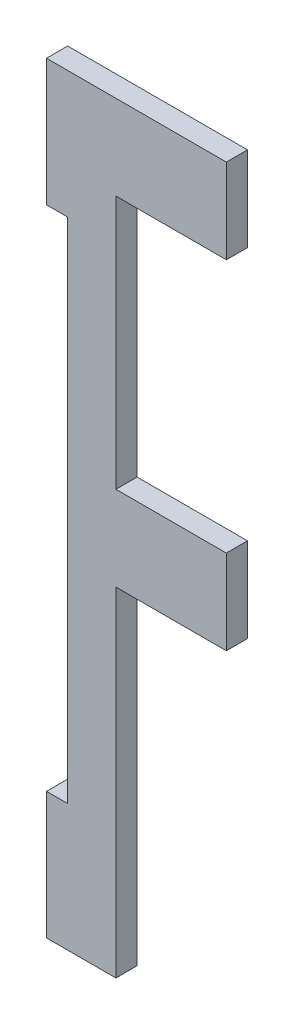
ISO-10303-21;
HEADER;
FILE_DESCRIPTION(('STEP AP214'),'2;1');
FILE_NAME('part.step','',(''),(''),'','','');
FILE_SCHEMA(('AUTOMOTIVE_DESIGN { 1 0 10303 214 1 1 1 1 }'));
ENDSEC;
DATA;
#1=APPLICATION_CONTEXT('core data for automotive mechanical design processes');
#2=APPLICATION_PROTOCOL_DEFINITION('international standard','automotive_design',2000,#1);
#3=PRODUCT_CONTEXT('',#1,'mechanical');
#4=PRODUCT('Part','Part','',(#3));
#5=PRODUCT_RELATED_PRODUCT_CATEGORY('part','',(#4));
#6=PRODUCT_DEFINITION_FORMATION('','',#4);
#7=PRODUCT_DEFINITION_CONTEXT('part definition',#1,'design');
#8=PRODUCT_DEFINITION('design','',#6,#7);
#9=PRODUCT_DEFINITION_SHAPE('','',#8);
#10=(LENGTH_UNIT() NAMED_UNIT(*) SI_UNIT(.MILLI.,.METRE.));
#11=(NAMED_UNIT(*) PLANE_ANGLE_UNIT() SI_UNIT($,.RADIAN.));
#12=(NAMED_UNIT(*) SI_UNIT($,.STERADIAN.) SOLID_ANGLE_UNIT());
#13=UNCERTAINTY_MEASURE_WITH_UNIT(LENGTH_MEASURE(1.E-05),#10,'distance_accuracy_value','');
#14=(GEOMETRIC_REPRESENTATION_CONTEXT(3) GLOBAL_UNCERTAINTY_ASSIGNED_CONTEXT((#13)) GLOBAL_UNIT_ASSIGNED_CONTEXT((#10,
#11,#12)) REPRESENTATION_CONTEXT('',''));
#15=CARTESIAN_POINT('',(0.,0.,0.));
#16=DIRECTION('',(0.,0.,1.));
#17=DIRECTION('',(1.,0.,0.));
#18=AXIS2_PLACEMENT_3D('',#15,#16,#17);
#19=CARTESIAN_POINT('',(-3.175,19.05,3.175));
#20=DIRECTION('',(0.,-1.,0.));
#21=DIRECTION('',(0.,0.,-1.));
#22=AXIS2_PLACEMENT_3D('',#19,#20,#21);
#23=PLANE('',#22);
#24=DIRECTION('',(-1.,0.,0.));
#25=VECTOR('',#24,1.);
#26=CARTESIAN_POINT('',(-3.175,19.05,0.));
#27=LINE('',#26,#25);
#28=CARTESIAN_POINT('',(23.8125,19.05,0.));
#29=VERTEX_POINT('',#28);
#30=CARTESIAN_POINT('',(-3.175,19.05,0.));
#31=VERTEX_POINT('',#30);
#32=EDGE_CURVE('E167',#29,#31,#27,.T.);
#33=ORIENTED_EDGE('',*,*,#32,.T.);
#34=DIRECTION('',(0.,0.,-1.));
#35=VECTOR('',#34,1.);
#36=CARTESIAN_POINT('',(-3.175,19.05,3.175));
#37=LINE('',#36,#35);
#38=CARTESIAN_POINT('',(-3.175,19.05,3.175));
#39=VERTEX_POINT('',#38);
#40=EDGE_CURVE('E11',#39,#31,#37,.T.);
#41=ORIENTED_EDGE('',*,*,#40,.F.);
#42=DIRECTION('',(-1.,0.,0.));
#43=VECTOR('',#42,1.);
#44=CARTESIAN_POINT('',(-3.175,19.05,3.175));
#45=LINE('',#44,#43);
#46=CARTESIAN_POINT('',(23.8125,19.05,3.175));
#47=VERTEX_POINT('',#46);
#48=EDGE_CURVE('E193',#47,#39,#45,.T.);
#49=ORIENTED_EDGE('',*,*,#48,.F.);
#50=DIRECTION('',(0.,0.,-1.));
#51=VECTOR('',#50,1.);
#52=CARTESIAN_POINT('',(23.8125,19.05,3.175));
#53=LINE('',#52,#51);
#54=EDGE_CURVE('E163',#47,#29,#53,.T.);
#55=ORIENTED_EDGE('',*,*,#54,.T.);
#56=EDGE_LOOP('',(#33,#41,#49,#55));
#57=FACE_BOUND('',#56,.T.);
#58=ADVANCED_FACE('F35',(#57),#23,.F.);
#59=CARTESIAN_POINT('',(-3.175,19.05,3.175));
#60=DIRECTION('',(1.,0.,0.));
#61=DIRECTION('',(0.,1.,0.));
#62=AXIS2_PLACEMENT_3D('',#59,#60,#61);
#63=PLANE('',#62);
#64=DIRECTION('',(0.,-1.,0.));
#65=VECTOR('',#64,1.);
#66=CARTESIAN_POINT('',(-3.175,19.05,0.));
#67=LINE('',#66,#65);
#68=CARTESIAN_POINT('',(-3.175,0.,0.));
#69=VERTEX_POINT('',#68);
#70=EDGE_CURVE('E170',#31,#69,#67,.T.);
#71=ORIENTED_EDGE('',*,*,#70,.T.);
#72=DIRECTION('',(0.,0.,-1.));
#73=VECTOR('',#72,1.);
#74=CARTESIAN_POINT('',(-3.175,0.,3.175));
#75=LINE('',#74,#73);
#76=CARTESIAN_POINT('',(-3.175,0.,3.175));
#77=VERTEX_POINT('',#76);
#78=EDGE_CURVE('E43',#77,#69,#75,.T.);
#79=ORIENTED_EDGE('',*,*,#78,.F.);
#80=DIRECTION('',(0.,-1.,0.));
#81=VECTOR('',#80,1.);
#82=CARTESIAN_POINT('',(-3.175,19.05,3.175));
#83=LINE('',#82,#81);
#84=EDGE_CURVE('E112',#39,#77,#83,.T.);
#85=ORIENTED_EDGE('',*,*,#84,.F.);
#86=ORIENTED_EDGE('',*,*,#40,.T.);
#87=EDGE_LOOP('',(#71,#79,#85,#86));
#88=FACE_BOUND('',#87,.T.);
#89=ADVANCED_FACE('F281',(#88),#63,.F.);
#90=CARTESIAN_POINT('',(-3.175,0.,3.175));
#91=DIRECTION('',(0.,1.,0.));
#92=DIRECTION('',(0.,0.,1.));
#93=AXIS2_PLACEMENT_3D('',#90,#91,#92);
#94=PLANE('',#93);
#95=DIRECTION('',(1.,0.,0.));
#96=VECTOR('',#95,1.);
#97=CARTESIAN_POINT('',(-3.175,0.,0.));
#98=LINE('',#97,#96);
#99=CARTESIAN_POINT('',(0.,0.,0.));
#100=VERTEX_POINT('',#99);
#101=EDGE_CURVE('E172',#69,#100,#98,.T.);
#102=ORIENTED_EDGE('',*,*,#101,.T.);
#103=DIRECTION('',(0.,0.,-1.));
#104=VECTOR('',#103,1.);
#105=CARTESIAN_POINT('',(0.,0.,3.175));
#106=LINE('',#105,#104);
#107=CARTESIAN_POINT('',(0.,0.,3.175));
#108=VERTEX_POINT('',#107);
#109=EDGE_CURVE('E218',#108,#100,#106,.T.);
#110=ORIENTED_EDGE('',*,*,#109,.F.);
#111=DIRECTION('',(1.,0.,0.));
#112=VECTOR('',#111,1.);
#113=CARTESIAN_POINT('',(-3.175,0.,3.175));
#114=LINE('',#113,#112);
#115=EDGE_CURVE('E226',#77,#108,#114,.T.);
#116=ORIENTED_EDGE('',*,*,#115,.F.);
#117=ORIENTED_EDGE('',*,*,#78,.T.);
#118=EDGE_LOOP('',(#102,#110,#116,#117));
#119=FACE_BOUND('',#118,.T.);
#120=ADVANCED_FACE('F224',(#119),#94,.F.);
#121=CARTESIAN_POINT('',(0.,-76.2,3.175));
#122=DIRECTION('',(1.,0.,0.));
#123=DIRECTION('',(0.,1.,0.));
#124=AXIS2_PLACEMENT_3D('',#121,#122,#123);
#125=PLANE('',#124);
#126=DIRECTION('',(0.,-1.,0.));
#127=VECTOR('',#126,1.);
#128=CARTESIAN_POINT('',(0.,-76.2,0.));
#129=LINE('',#128,#127);
#130=CARTESIAN_POINT('',(0.,-76.2,0.));
#131=VERTEX_POINT('',#130);
#132=EDGE_CURVE('E174',#100,#131,#129,.T.);
#133=ORIENTED_EDGE('',*,*,#132,.T.);
#134=DIRECTION('',(0.,0.,-1.));
#135=VECTOR('',#134,1.);
#136=CARTESIAN_POINT('',(0.,-76.2,3.175));
#137=LINE('',#136,#135);
#138=CARTESIAN_POINT('',(0.,-76.2,3.175));
#139=VERTEX_POINT('',#138);
#140=EDGE_CURVE('E215',#139,#131,#137,.T.);
#141=ORIENTED_EDGE('',*,*,#140,.F.);
#142=DIRECTION('',(0.,-1.,0.));
#143=VECTOR('',#142,1.);
#144=CARTESIAN_POINT('',(0.,-76.2,3.175));
#145=LINE('',#144,#143);
#146=EDGE_CURVE('E244',#108,#139,#145,.T.);
#147=ORIENTED_EDGE('',*,*,#146,.F.);
#148=ORIENTED_EDGE('',*,*,#109,.T.);
#149=EDGE_LOOP('',(#133,#141,#147,#148));
#150=FACE_BOUND('',#149,.T.);
#151=ADVANCED_FACE('F235',(#150),#125,.F.);
#152=CARTESIAN_POINT('',(0.,-76.2,3.175));
#153=DIRECTION('',(0.,-1.,0.));
#154=DIRECTION('',(0.,0.,-1.));
#155=AXIS2_PLACEMENT_3D('',#152,#153,#154);
#156=PLANE('',#155);
#157=DIRECTION('',(-1.,0.,0.));
#158=VECTOR('',#157,1.);
#159=CARTESIAN_POINT('',(0.,-76.2,0.));
#160=LINE('',#159,#158);
#161=CARTESIAN_POINT('',(-3.175,-76.2,0.));
#162=VERTEX_POINT('',#161);
#163=EDGE_CURVE('E176',#131,#162,#160,.T.);
#164=ORIENTED_EDGE('',*,*,#163,.T.);
#165=DIRECTION('',(0.,0.,-1.));
#166=VECTOR('',#165,1.);
#167=CARTESIAN_POINT('',(-3.175,-76.2,3.175));
#168=LINE('',#167,#166);
#169=CARTESIAN_POINT('',(-3.175,-76.2,3.175));
#170=VERTEX_POINT('',#169);
#171=EDGE_CURVE('E212',#170,#162,#168,.T.);
#172=ORIENTED_EDGE('',*,*,#171,.F.);
#173=DIRECTION('',(-1.,0.,0.));
#174=VECTOR('',#173,1.);
#175=CARTESIAN_POINT('',(0.,-76.2,3.175));
#176=LINE('',#175,#174);
#177=EDGE_CURVE('E241',#139,#170,#176,.T.);
#178=ORIENTED_EDGE('',*,*,#177,.F.);
#179=ORIENTED_EDGE('',*,*,#140,.T.);
#180=EDGE_LOOP('',(#164,#172,#178,#179));
#181=FACE_BOUND('',#180,.T.);
#182=ADVANCED_FACE('F239',(#181),#156,.F.);
#183=CARTESIAN_POINT('',(-3.175,-76.2,3.175));
#184=DIRECTION('',(1.,0.,0.));
#185=DIRECTION('',(0.,1.,0.));
#186=AXIS2_PLACEMENT_3D('',#183,#184,#185);
#187=PLANE('',#186);
#188=DIRECTION('',(0.,-1.,0.));
#189=VECTOR('',#188,1.);
#190=CARTESIAN_POINT('',(-3.175,-76.2,0.));
#191=LINE('',#190,#189);
#192=CARTESIAN_POINT('',(-3.175,-95.25,0.));
#193=VERTEX_POINT('',#192);
#194=EDGE_CURVE('E178',#162,#193,#191,.T.);
#195=ORIENTED_EDGE('',*,*,#194,.T.);
#196=DIRECTION('',(0.,0.,-1.));
#197=VECTOR('',#196,1.);
#198=CARTESIAN_POINT('',(-3.175,-95.25,3.175));
#199=LINE('',#198,#197);
#200=CARTESIAN_POINT('',(-3.175,-95.25,3.175));
#201=VERTEX_POINT('',#200);
#202=EDGE_CURVE('E209',#201,#193,#199,.T.);
#203=ORIENTED_EDGE('',*,*,#202,.F.);
#204=DIRECTION('',(0.,-1.,0.));
#205=VECTOR('',#204,1.);
#206=CARTESIAN_POINT('',(-3.175,-76.2,3.175));
#207=LINE('',#206,#205);
#208=EDGE_CURVE('E243',#170,#201,#207,.T.);
#209=ORIENTED_EDGE('',*,*,#208,.F.);
#210=ORIENTED_EDGE('',*,*,#171,.T.);
#211=EDGE_LOOP('',(#195,#203,#209,#210));
#212=FACE_BOUND('',#211,.T.);
#213=ADVANCED_FACE('F294',(#212),#187,.F.);
#214=CARTESIAN_POINT('',(-3.175,-95.25,3.175));
#215=DIRECTION('',(0.,1.,0.));
#216=DIRECTION('',(-1.,0.,0.));
#217=AXIS2_PLACEMENT_3D('',#214,#215,#216);
#218=PLANE('',#217);
#219=DIRECTION('',(1.,0.,0.));
#220=VECTOR('',#219,1.);
#221=CARTESIAN_POINT('',(-3.175,-95.25,0.));
#222=LINE('',#221,#220);
#223=CARTESIAN_POINT('',(7.239,-95.25,0.));
#224=VERTEX_POINT('',#223);
#225=EDGE_CURVE('E180',#193,#224,#222,.T.);
#226=ORIENTED_EDGE('',*,*,#225,.T.);
#227=DIRECTION('',(0.,0.,-1.));
#228=VECTOR('',#227,1.);
#229=CARTESIAN_POINT('',(7.239,-95.25,3.175));
#230=LINE('',#229,#228);
#231=CARTESIAN_POINT('',(7.239,-95.25,3.175));
#232=VERTEX_POINT('',#231);
#233=EDGE_CURVE('E206',#232,#224,#230,.T.);
#234=ORIENTED_EDGE('',*,*,#233,.F.);
#235=DIRECTION('',(1.,0.,0.));
#236=VECTOR('',#235,1.);
#237=CARTESIAN_POINT('',(-3.175,-95.25,3.175));
#238=LINE('',#237,#236);
#239=EDGE_CURVE('E246',#201,#232,#238,.T.);
#240=ORIENTED_EDGE('',*,*,#239,.F.);
#241=ORIENTED_EDGE('',*,*,#202,.T.);
#242=EDGE_LOOP('',(#226,#234,#240,#241));
#243=FACE_BOUND('',#242,.T.);
#244=ADVANCED_FACE('F297',(#243),#218,.F.);
#245=CARTESIAN_POINT('',(7.239,-95.25,3.175));
#246=DIRECTION('',(-1.,0.,0.));
#247=DIRECTION('',(0.,-1.,0.));
#248=AXIS2_PLACEMENT_3D('',#245,#246,#247);
#249=PLANE('',#248);
#250=DIRECTION('',(0.,1.,0.));
#251=VECTOR('',#250,1.);
#252=CARTESIAN_POINT('',(7.239,-95.25,0.));
#253=LINE('',#252,#251);
#254=CARTESIAN_POINT('',(7.239,-44.45,0.));
#255=VERTEX_POINT('',#254);
#256=EDGE_CURVE('E182',#224,#255,#253,.T.);
#257=ORIENTED_EDGE('',*,*,#256,.T.);
#258=DIRECTION('',(0.,0.,-1.));
#259=VECTOR('',#258,1.);
#260=CARTESIAN_POINT('',(7.239,-44.45,3.175));
#261=LINE('',#260,#259);
#262=CARTESIAN_POINT('',(7.239,-44.45,3.175));
#263=VERTEX_POINT('',#262);
#264=EDGE_CURVE('E203',#263,#255,#261,.T.);
#265=ORIENTED_EDGE('',*,*,#264,.F.);
#266=DIRECTION('',(0.,1.,0.));
#267=VECTOR('',#266,1.);
#268=CARTESIAN_POINT('',(7.239,-95.25,3.175));
#269=LINE('',#268,#267);
#270=EDGE_CURVE('E252',#232,#263,#269,.T.);
#271=ORIENTED_EDGE('',*,*,#270,.F.);
#272=ORIENTED_EDGE('',*,*,#233,.T.);
#273=EDGE_LOOP('',(#257,#265,#271,#272));
#274=FACE_BOUND('',#273,.T.);
#275=ADVANCED_FACE('F301',(#274),#249,.F.);
#276=CARTESIAN_POINT('',(23.8125,-44.45,3.175));
#277=DIRECTION('',(0.,1.,0.));
#278=DIRECTION('',(-1.,0.,0.));
#279=AXIS2_PLACEMENT_3D('',#276,#277,#278);
#280=PLANE('',#279);
#281=DIRECTION('',(1.,0.,0.));
#282=VECTOR('',#281,1.);
#283=CARTESIAN_POINT('',(23.8125,-44.45,0.));
#284=LINE('',#283,#282);
#285=CARTESIAN_POINT('',(23.8125,-44.45,0.));
#286=VERTEX_POINT('',#285);
#287=EDGE_CURVE('E184',#255,#286,#284,.T.);
#288=ORIENTED_EDGE('',*,*,#287,.T.);
#289=DIRECTION('',(0.,0.,-1.));
#290=VECTOR('',#289,1.);
#291=CARTESIAN_POINT('',(23.8125,-44.45,3.175));
#292=LINE('',#291,#290);
#293=CARTESIAN_POINT('',(23.8125,-44.45,3.175));
#294=VERTEX_POINT('',#293);
#295=EDGE_CURVE('E200',#294,#286,#292,.T.);
#296=ORIENTED_EDGE('',*,*,#295,.F.);
#297=DIRECTION('',(1.,0.,0.));
#298=VECTOR('',#297,1.);
#299=CARTESIAN_POINT('',(23.8125,-44.45,3.175));
#300=LINE('',#299,#298);
#301=EDGE_CURVE('E254',#263,#294,#300,.T.);
#302=ORIENTED_EDGE('',*,*,#301,.F.);
#303=ORIENTED_EDGE('',*,*,#264,.T.);
#304=EDGE_LOOP('',(#288,#296,#302,#303));
#305=FACE_BOUND('',#304,.T.);
#306=ADVANCED_FACE('F305',(#305),#280,.F.);
#307=CARTESIAN_POINT('',(23.8125,-31.75,3.175));
#308=DIRECTION('',(-1.,0.,0.));
#309=DIRECTION('',(0.,0.,1.));
#310=AXIS2_PLACEMENT_3D('',#307,#308,#309);
#311=PLANE('',#310);
#312=DIRECTION('',(0.,1.,0.));
#313=VECTOR('',#312,1.);
#314=CARTESIAN_POINT('',(23.8125,-31.75,0.));
#315=LINE('',#314,#313);
#316=CARTESIAN_POINT('',(23.8125,-31.75,0.));
#317=VERTEX_POINT('',#316);
#318=EDGE_CURVE('E186',#286,#317,#315,.T.);
#319=ORIENTED_EDGE('',*,*,#318,.T.);
#320=DIRECTION('',(0.,0.,-1.));
#321=VECTOR('',#320,1.);
#322=CARTESIAN_POINT('',(23.8125,-31.75,3.175));
#323=LINE('',#322,#321);
#324=CARTESIAN_POINT('',(23.8125,-31.75,3.175));
#325=VERTEX_POINT('',#324);
#326=EDGE_CURVE('E197',#325,#317,#323,.T.);
#327=ORIENTED_EDGE('',*,*,#326,.F.);
#328=DIRECTION('',(0.,1.,0.));
#329=VECTOR('',#328,1.);
#330=CARTESIAN_POINT('',(23.8125,-31.75,3.175));
#331=LINE('',#330,#329);
#332=EDGE_CURVE('E256',#294,#325,#331,.T.);
#333=ORIENTED_EDGE('',*,*,#332,.F.);
#334=ORIENTED_EDGE('',*,*,#295,.T.);
#335=EDGE_LOOP('',(#319,#327,#333,#334));
#336=FACE_BOUND('',#335,.T.);
#337=ADVANCED_FACE('F262',(#336),#311,.F.);
#338=CARTESIAN_POINT('',(7.239,-31.75,3.175));
#339=DIRECTION('',(0.,-1.,0.));
#340=DIRECTION('',(0.,0.,-1.));
#341=AXIS2_PLACEMENT_3D('',#338,#339,#340);
#342=PLANE('',#341);
#343=DIRECTION('',(-1.,0.,0.));
#344=VECTOR('',#343,1.);
#345=CARTESIAN_POINT('',(7.239,-31.75,0.));
#346=LINE('',#345,#344);
#347=CARTESIAN_POINT('',(7.239,-31.75,0.));
#348=VERTEX_POINT('',#347);
#349=EDGE_CURVE('E188',#317,#348,#346,.T.);
#350=ORIENTED_EDGE('',*,*,#349,.T.);
#351=DIRECTION('',(0.,0.,-1.));
#352=VECTOR('',#351,1.);
#353=CARTESIAN_POINT('',(7.239,-31.75,3.175));
#354=LINE('',#353,#352);
#355=CARTESIAN_POINT('',(7.239,-31.75,3.175));
#356=VERTEX_POINT('',#355);
#357=EDGE_CURVE('E158',#356,#348,#354,.T.);
#358=ORIENTED_EDGE('',*,*,#357,.F.);
#359=DIRECTION('',(-1.,0.,0.));
#360=VECTOR('',#359,1.);
#361=CARTESIAN_POINT('',(7.239,-31.75,3.175));
#362=LINE('',#361,#360);
#363=EDGE_CURVE('E149',#325,#356,#362,.T.);
#364=ORIENTED_EDGE('',*,*,#363,.F.);
#365=ORIENTED_EDGE('',*,*,#326,.T.);
#366=EDGE_LOOP('',(#350,#358,#364,#365));
#367=FACE_BOUND('',#366,.T.);
#368=ADVANCED_FACE('F266',(#367),#342,.F.);
#369=CARTESIAN_POINT('',(7.239,6.35,3.175));
#370=DIRECTION('',(-1.,0.,0.));
#371=DIRECTION('',(0.,-1.,0.));
#372=AXIS2_PLACEMENT_3D('',#369,#370,#371);
#373=PLANE('',#372);
#374=DIRECTION('',(0.,1.,0.));
#375=VECTOR('',#374,1.);
#376=CARTESIAN_POINT('',(7.239,6.35,0.));
#377=LINE('',#376,#375);
#378=CARTESIAN_POINT('',(7.239,6.35,0.));
#379=VERTEX_POINT('',#378);
#380=EDGE_CURVE('E157',#348,#379,#377,.T.);
#381=ORIENTED_EDGE('',*,*,#380,.T.);
#382=DIRECTION('',(0.,0.,-1.));
#383=VECTOR('',#382,1.);
#384=CARTESIAN_POINT('',(7.239,6.35,3.175));
#385=LINE('',#384,#383);
#386=CARTESIAN_POINT('',(7.239,6.35,3.175));
#387=VERTEX_POINT('',#386);
#388=EDGE_CURVE('E154',#387,#379,#385,.T.);
#389=ORIENTED_EDGE('',*,*,#388,.F.);
#390=DIRECTION('',(0.,1.,0.));
#391=VECTOR('',#390,1.);
#392=CARTESIAN_POINT('',(7.239,6.35,3.175));
#393=LINE('',#392,#391);
#394=EDGE_CURVE('E143',#356,#387,#393,.T.);
#395=ORIENTED_EDGE('',*,*,#394,.F.);
#396=ORIENTED_EDGE('',*,*,#357,.T.);
#397=EDGE_LOOP('',(#381,#389,#395,#396));
#398=FACE_BOUND('',#397,.T.);
#399=ADVANCED_FACE('F155',(#398),#373,.F.);
#400=CARTESIAN_POINT('',(23.8125,6.35,3.175));
#401=DIRECTION('',(0.,1.,0.));
#402=DIRECTION('',(-1.,0.,0.));
#403=AXIS2_PLACEMENT_3D('',#400,#401,#402);
#404=PLANE('',#403);
#405=DIRECTION('',(1.,0.,0.));
#406=VECTOR('',#405,1.);
#407=CARTESIAN_POINT('',(23.8125,6.35,0.));
#408=LINE('',#407,#406);
#409=CARTESIAN_POINT('',(23.8125,6.35,0.));
#410=VERTEX_POINT('',#409);
#411=EDGE_CURVE('E98',#379,#410,#408,.T.);
#412=ORIENTED_EDGE('',*,*,#411,.T.);
#413=DIRECTION('',(0.,0.,-1.));
#414=VECTOR('',#413,1.);
#415=CARTESIAN_POINT('',(23.8125,6.35,3.175));
#416=LINE('',#415,#414);
#417=CARTESIAN_POINT('',(23.8125,6.35,3.175));
#418=VERTEX_POINT('',#417);
#419=EDGE_CURVE('E159',#418,#410,#416,.T.);
#420=ORIENTED_EDGE('',*,*,#419,.F.);
#421=DIRECTION('',(1.,0.,0.));
#422=VECTOR('',#421,1.);
#423=CARTESIAN_POINT('',(23.8125,6.35,3.175));
#424=LINE('',#423,#422);
#425=EDGE_CURVE('E147',#387,#418,#424,.T.);
#426=ORIENTED_EDGE('',*,*,#425,.F.);
#427=ORIENTED_EDGE('',*,*,#388,.T.);
#428=EDGE_LOOP('',(#412,#420,#426,#427));
#429=FACE_BOUND('',#428,.T.);
#430=ADVANCED_FACE('F161',(#429),#404,.F.);
#431=CARTESIAN_POINT('',(23.8125,19.05,3.175));
#432=DIRECTION('',(-1.,0.,0.));
#433=DIRECTION('',(0.,-1.,0.));
#434=AXIS2_PLACEMENT_3D('',#431,#432,#433);
#435=PLANE('',#434);
#436=DIRECTION('',(0.,1.,0.));
#437=VECTOR('',#436,1.);
#438=CARTESIAN_POINT('',(23.8125,19.05,0.));
#439=LINE('',#438,#437);
#440=EDGE_CURVE('E104',#410,#29,#439,.T.);
#441=ORIENTED_EDGE('',*,*,#440,.T.);
#442=ORIENTED_EDGE('',*,*,#54,.F.);
#443=DIRECTION('',(0.,1.,0.));
#444=VECTOR('',#443,1.);
#445=CARTESIAN_POINT('',(23.8125,19.05,3.175));
#446=LINE('',#445,#444);
#447=EDGE_CURVE('E51',#418,#47,#446,.T.);
#448=ORIENTED_EDGE('',*,*,#447,.F.);
#449=ORIENTED_EDGE('',*,*,#419,.T.);
#450=EDGE_LOOP('',(#441,#442,#448,#449));
#451=FACE_BOUND('',#450,.T.);
#452=ADVANCED_FACE('F270',(#451),#435,.F.);
#453=CARTESIAN_POINT('',(23.8125,19.05,3.175));
#454=DIRECTION('',(0.,0.,-1.));
#455=DIRECTION('',(-1.,0.,0.));
#456=AXIS2_PLACEMENT_3D('',#453,#454,#455);
#457=PLANE('',#456);
#458=ORIENTED_EDGE('',*,*,#48,.T.);
#459=ORIENTED_EDGE('',*,*,#84,.T.);
#460=ORIENTED_EDGE('',*,*,#115,.T.);
#461=ORIENTED_EDGE('',*,*,#146,.T.);
#462=ORIENTED_EDGE('',*,*,#177,.T.);
#463=ORIENTED_EDGE('',*,*,#208,.T.);
#464=ORIENTED_EDGE('',*,*,#239,.T.);
#465=ORIENTED_EDGE('',*,*,#270,.T.);
#466=ORIENTED_EDGE('',*,*,#301,.T.);
#467=ORIENTED_EDGE('',*,*,#332,.T.);
#468=ORIENTED_EDGE('',*,*,#363,.T.);
#469=ORIENTED_EDGE('',*,*,#394,.T.);
#470=ORIENTED_EDGE('',*,*,#425,.T.);
#471=ORIENTED_EDGE('',*,*,#447,.T.);
#472=EDGE_LOOP('',(#458,#459,#460,#461,#462,#463,#464,#465,#466,#467,#468,#469,#470,#471));
#473=FACE_BOUND('',#472,.T.);
#474=ADVANCED_FACE('F145',(#473),#457,.F.);
#475=CARTESIAN_POINT('',(23.8125,19.05,0.));
#476=DIRECTION('',(0.,0.,-1.));
#477=DIRECTION('',(-1.,0.,0.));
#478=AXIS2_PLACEMENT_3D('',#475,#476,#477);
#479=PLANE('',#478);
#480=ORIENTED_EDGE('',*,*,#32,.F.);
#481=ORIENTED_EDGE('',*,*,#440,.F.);
#482=ORIENTED_EDGE('',*,*,#411,.F.);
#483=ORIENTED_EDGE('',*,*,#380,.F.);
#484=ORIENTED_EDGE('',*,*,#349,.F.);
#485=ORIENTED_EDGE('',*,*,#318,.F.);
#486=ORIENTED_EDGE('',*,*,#287,.F.);
#487=ORIENTED_EDGE('',*,*,#256,.F.);
#488=ORIENTED_EDGE('',*,*,#225,.F.);
#489=ORIENTED_EDGE('',*,*,#194,.F.);
#490=ORIENTED_EDGE('',*,*,#163,.F.);
#491=ORIENTED_EDGE('',*,*,#132,.F.);
#492=ORIENTED_EDGE('',*,*,#101,.F.);
#493=ORIENTED_EDGE('',*,*,#70,.F.);
#494=EDGE_LOOP('',(#480,#481,#482,#483,#484,#485,#486,#487,#488,#489,#490,#491,#492,#493));
#495=FACE_BOUND('',#494,.T.);
#496=ADVANCED_FACE('F230',(#495),#479,.T.);
#497=CLOSED_SHELL('',(#58,#89,#120,#151,#182,#213,#244,#275,#306,#337,#368,#399,#430,#452,#474,#496));
#498=MANIFOLD_SOLID_BREP('B2',#497);
#499=ADVANCED_BREP_SHAPE_REPRESENTATION('',(#18,#498),#14);
#500=SHAPE_DEFINITION_REPRESENTATION(#9,#499);
ENDSEC;
END-ISO-10303-21;
